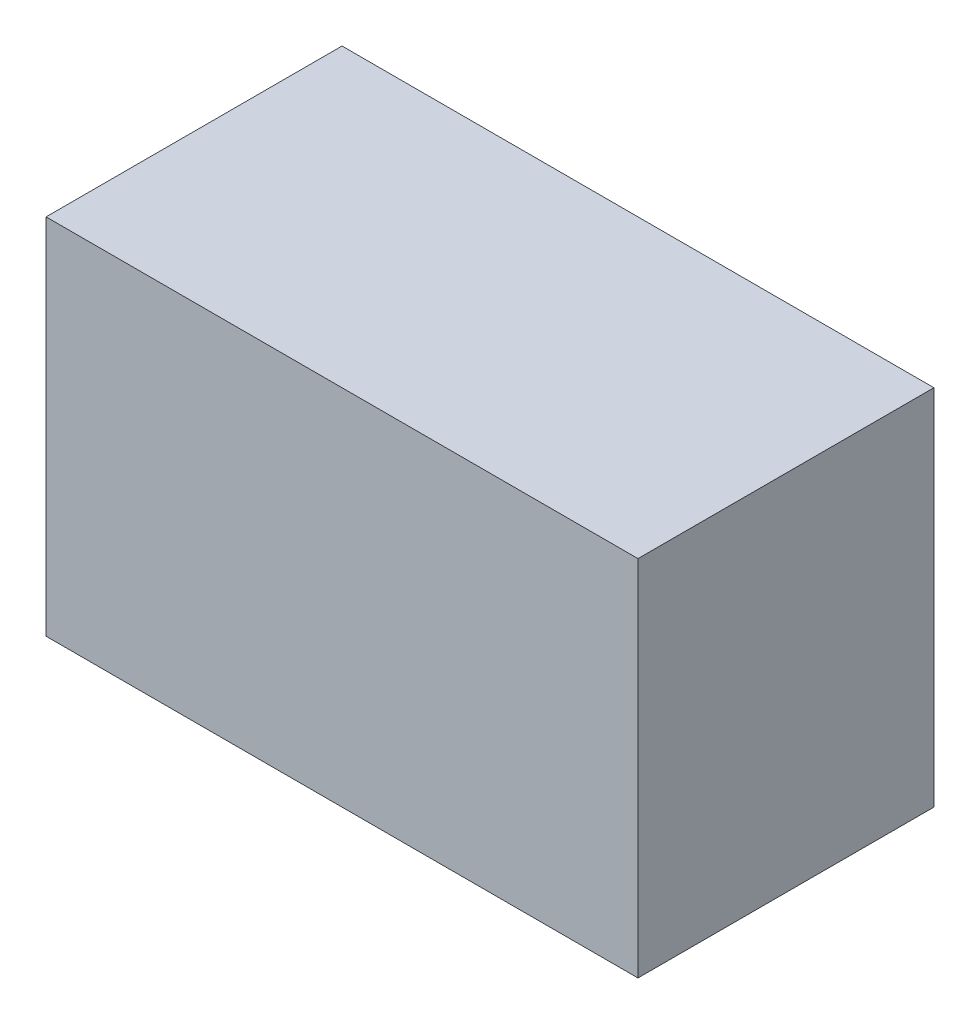
ISO-10303-21;
HEADER;
FILE_DESCRIPTION(('STEP AP214'),'2;1');
FILE_NAME('part.step','',(''),(''),'','','');
FILE_SCHEMA(('AUTOMOTIVE_DESIGN { 1 0 10303 214 1 1 1 1 }'));
ENDSEC;
DATA;
#1=APPLICATION_CONTEXT('core data for automotive mechanical design processes');
#2=APPLICATION_PROTOCOL_DEFINITION('international standard','automotive_design',2000,#1);
#3=PRODUCT_CONTEXT('',#1,'mechanical');
#4=PRODUCT('Part','Part','',(#3));
#5=PRODUCT_RELATED_PRODUCT_CATEGORY('part','',(#4));
#6=PRODUCT_DEFINITION_FORMATION('','',#4);
#7=PRODUCT_DEFINITION_CONTEXT('part definition',#1,'design');
#8=PRODUCT_DEFINITION('design','',#6,#7);
#9=PRODUCT_DEFINITION_SHAPE('','',#8);
#10=(LENGTH_UNIT() NAMED_UNIT(*) SI_UNIT(.MILLI.,.METRE.));
#11=(NAMED_UNIT(*) PLANE_ANGLE_UNIT() SI_UNIT($,.RADIAN.));
#12=(NAMED_UNIT(*) SI_UNIT($,.STERADIAN.) SOLID_ANGLE_UNIT());
#13=UNCERTAINTY_MEASURE_WITH_UNIT(LENGTH_MEASURE(1.E-05),#10,'distance_accuracy_value','');
#14=(GEOMETRIC_REPRESENTATION_CONTEXT(3) GLOBAL_UNCERTAINTY_ASSIGNED_CONTEXT((#13)) GLOBAL_UNIT_ASSIGNED_CONTEXT((#10,
#11,#12)) REPRESENTATION_CONTEXT('',''));
#15=CARTESIAN_POINT('',(0.,0.,0.));
#16=DIRECTION('',(0.,0.,1.));
#17=DIRECTION('',(1.,0.,0.));
#18=AXIS2_PLACEMENT_3D('',#15,#16,#17);
#19=CARTESIAN_POINT('',(1.10000034,0.67499738,1.10000034));
#20=DIRECTION('',(0.,0.,-1.));
#21=DIRECTION('',(-1.,0.,0.));
#22=AXIS2_PLACEMENT_3D('',#19,#20,#21);
#23=PLANE('',#22);
#24=DIRECTION('',(-1.88148524222543E-06,0.99999999999823,0.));
#25=VECTOR('',#24,1.);
#26=CARTESIAN_POINT('',(-1.10000034,0.67499992,1.10000034));
#27=LINE('',#26,#25);
#28=CARTESIAN_POINT('',(-1.09999907,0.674999920000003,1.10000034));
#29=VERTEX_POINT('',#28);
#30=CARTESIAN_POINT('',(-1.0999978,-0.67499865,1.10000034));
#31=VERTEX_POINT('',#30);
#32=EDGE_CURVE('E55',#29,#31,#27,.F.);
#33=ORIENTED_EDGE('',*,*,#32,.T.);
#34=DIRECTION('',(-0.999999999999334,1.15454510278039E-06,0.));
#35=VECTOR('',#34,1.);
#36=CARTESIAN_POINT('',(-1.0999978,-0.67499738,1.10000034));
#37=LINE('',#36,#35);
#38=CARTESIAN_POINT('',(1.10000161,-0.674999920000003,1.10000034));
#39=VERTEX_POINT('',#38);
#40=EDGE_CURVE('E57',#31,#39,#37,.F.);
#41=ORIENTED_EDGE('',*,*,#40,.T.);
#42=DIRECTION('',(1.88148525275143E-06,-0.99999999999823,0.));
#43=VECTOR('',#42,1.);
#44=CARTESIAN_POINT('',(1.10000288,-0.67499992,1.10000034));
#45=LINE('',#44,#43);
#46=CARTESIAN_POINT('',(1.10000033999999,0.674998015,1.10000034));
#47=VERTEX_POINT('',#46);
#48=EDGE_CURVE('E20',#39,#47,#45,.F.);
#49=ORIENTED_EDGE('',*,*,#48,.T.);
#50=DIRECTION('',(0.999999999999334,-1.15454510278039E-06,0.));
#51=VECTOR('',#50,1.);
#52=CARTESIAN_POINT('',(1.10000034,0.67499738,1.10000034));
#53=LINE('',#52,#51);
#54=EDGE_CURVE('E80',#47,#29,#53,.F.);
#55=ORIENTED_EDGE('',*,*,#54,.T.);
#56=EDGE_LOOP('',(#33,#41,#49,#55));
#57=FACE_BOUND('',#56,.T.);
#58=ADVANCED_FACE('F17',(#57),#23,.F.);
#59=CARTESIAN_POINT('',(1.10000288,-0.67499992,0.));
#60=DIRECTION('',(-0.99999999999823,-1.88148525275143E-06,0.));
#61=DIRECTION('',(1.88148525275143E-06,-0.99999999999823,0.));
#62=AXIS2_PLACEMENT_3D('',#59,#60,#61);
#63=PLANE('',#62);
#64=DIRECTION('',(0.,0.,1.));
#65=VECTOR('',#64,1.);
#66=CARTESIAN_POINT('',(1.10000034,0.67499738,0.));
#67=LINE('',#66,#65);
#68=CARTESIAN_POINT('',(1.10000033999999,0.674998015,0.));
#69=VERTEX_POINT('',#68);
#70=EDGE_CURVE('E68',#69,#47,#67,.T.);
#71=ORIENTED_EDGE('',*,*,#70,.T.);
#72=ORIENTED_EDGE('',*,*,#48,.F.);
#73=DIRECTION('',(0.,0.,1.));
#74=VECTOR('',#73,1.);
#75=CARTESIAN_POINT('',(1.10000288,-0.674999920000011,0.));
#76=LINE('',#75,#74);
#77=CARTESIAN_POINT('',(1.100002245,-0.674999920000003,0.));
#78=VERTEX_POINT('',#77);
#79=EDGE_CURVE('E63',#39,#78,#76,.F.);
#80=ORIENTED_EDGE('',*,*,#79,.T.);
#81=DIRECTION('',(0.,1.,0.));
#82=VECTOR('',#81,1.);
#83=CARTESIAN_POINT('',(1.10000034,0.67499738,0.));
#84=LINE('',#83,#82);
#85=EDGE_CURVE('E83',#69,#78,#84,.F.);
#86=ORIENTED_EDGE('',*,*,#85,.F.);
#87=EDGE_LOOP('',(#71,#72,#80,#86));
#88=FACE_BOUND('',#87,.T.);
#89=ADVANCED_FACE('F65',(#88),#63,.F.);
#90=CARTESIAN_POINT('',(-1.0999978,-0.67499738,0.));
#91=DIRECTION('',(1.15454510278039E-06,0.999999999999334,0.));
#92=DIRECTION('',(-0.999999999999334,1.15454510278039E-06,0.));
#93=AXIS2_PLACEMENT_3D('',#90,#91,#92);
#94=PLANE('',#93);
#95=ORIENTED_EDGE('',*,*,#79,.F.);
#96=ORIENTED_EDGE('',*,*,#40,.F.);
#97=DIRECTION('',(0.,0.,1.));
#98=VECTOR('',#97,1.);
#99=CARTESIAN_POINT('',(-1.0999978,-0.67499738,0.));
#100=LINE('',#99,#98);
#101=CARTESIAN_POINT('',(-1.0999978,-0.674998015,0.));
#102=VERTEX_POINT('',#101);
#103=EDGE_CURVE('E75',#31,#102,#100,.F.);
#104=ORIENTED_EDGE('',*,*,#103,.T.);
#105=DIRECTION('',(-1.,0.,0.));
#106=VECTOR('',#105,1.);
#107=CARTESIAN_POINT('',(1.10000034,-0.67499992,0.));
#108=LINE('',#107,#106);
#109=EDGE_CURVE('E72',#78,#102,#108,.T.);
#110=ORIENTED_EDGE('',*,*,#109,.F.);
#111=EDGE_LOOP('',(#95,#96,#104,#110));
#112=FACE_BOUND('',#111,.T.);
#113=ADVANCED_FACE('F70',(#112),#94,.F.);
#114=CARTESIAN_POINT('',(-1.10000034,0.67499992,0.));
#115=DIRECTION('',(0.99999999999823,1.88148524222543E-06,0.));
#116=DIRECTION('',(-1.88148524222543E-06,0.99999999999823,0.));
#117=AXIS2_PLACEMENT_3D('',#114,#115,#116);
#118=PLANE('',#117);
#119=ORIENTED_EDGE('',*,*,#103,.F.);
#120=ORIENTED_EDGE('',*,*,#32,.F.);
#121=DIRECTION('',(0.,0.,1.));
#122=VECTOR('',#121,1.);
#123=CARTESIAN_POINT('',(-1.10000034,0.674999920000011,0.));
#124=LINE('',#123,#122);
#125=CARTESIAN_POINT('',(-1.099999705,0.674999920000003,0.));
#126=VERTEX_POINT('',#125);
#127=EDGE_CURVE('E35',#29,#126,#124,.F.);
#128=ORIENTED_EDGE('',*,*,#127,.T.);
#129=DIRECTION('',(0.,1.,0.));
#130=VECTOR('',#129,1.);
#131=CARTESIAN_POINT('',(-1.0999978,0.67499738,0.));
#132=LINE('',#131,#130);
#133=EDGE_CURVE('E26',#102,#126,#132,.T.);
#134=ORIENTED_EDGE('',*,*,#133,.F.);
#135=EDGE_LOOP('',(#119,#120,#128,#134));
#136=FACE_BOUND('',#135,.T.);
#137=ADVANCED_FACE('F89',(#136),#118,.F.);
#138=CARTESIAN_POINT('',(1.10000034,0.67499738,0.));
#139=DIRECTION('',(-1.15454510278039E-06,-0.999999999999334,0.));
#140=DIRECTION('',(0.999999999999334,-1.15454510278039E-06,0.));
#141=AXIS2_PLACEMENT_3D('',#138,#139,#140);
#142=PLANE('',#141);
#143=ORIENTED_EDGE('',*,*,#127,.F.);
#144=ORIENTED_EDGE('',*,*,#54,.F.);
#145=ORIENTED_EDGE('',*,*,#70,.F.);
#146=DIRECTION('',(-1.,0.,0.));
#147=VECTOR('',#146,1.);
#148=CARTESIAN_POINT('',(1.10000034,0.67499992,0.));
#149=LINE('',#148,#147);
#150=EDGE_CURVE('E11',#126,#69,#149,.F.);
#151=ORIENTED_EDGE('',*,*,#150,.F.);
#152=EDGE_LOOP('',(#143,#144,#145,#151));
#153=FACE_BOUND('',#152,.T.);
#154=ADVANCED_FACE('F91',(#153),#142,.F.);
#155=CARTESIAN_POINT('',(1.10000034,0.67499738,0.));
#156=DIRECTION('',(0.,0.,-1.));
#157=DIRECTION('',(-1.,0.,0.));
#158=AXIS2_PLACEMENT_3D('',#155,#156,#157);
#159=PLANE('',#158);
#160=ORIENTED_EDGE('',*,*,#133,.T.);
#161=ORIENTED_EDGE('',*,*,#150,.T.);
#162=ORIENTED_EDGE('',*,*,#85,.T.);
#163=ORIENTED_EDGE('',*,*,#109,.T.);
#164=EDGE_LOOP('',(#160,#161,#162,#163));
#165=FACE_BOUND('',#164,.T.);
#166=ADVANCED_FACE('F88',(#165),#159,.T.);
#167=CLOSED_SHELL('',(#58,#89,#113,#137,#154,#166));
#168=MANIFOLD_SOLID_BREP('B1',#167);
#169=ADVANCED_BREP_SHAPE_REPRESENTATION('',(#18,#168),#14);
#170=SHAPE_DEFINITION_REPRESENTATION(#9,#169);
ENDSEC;
END-ISO-10303-21;
